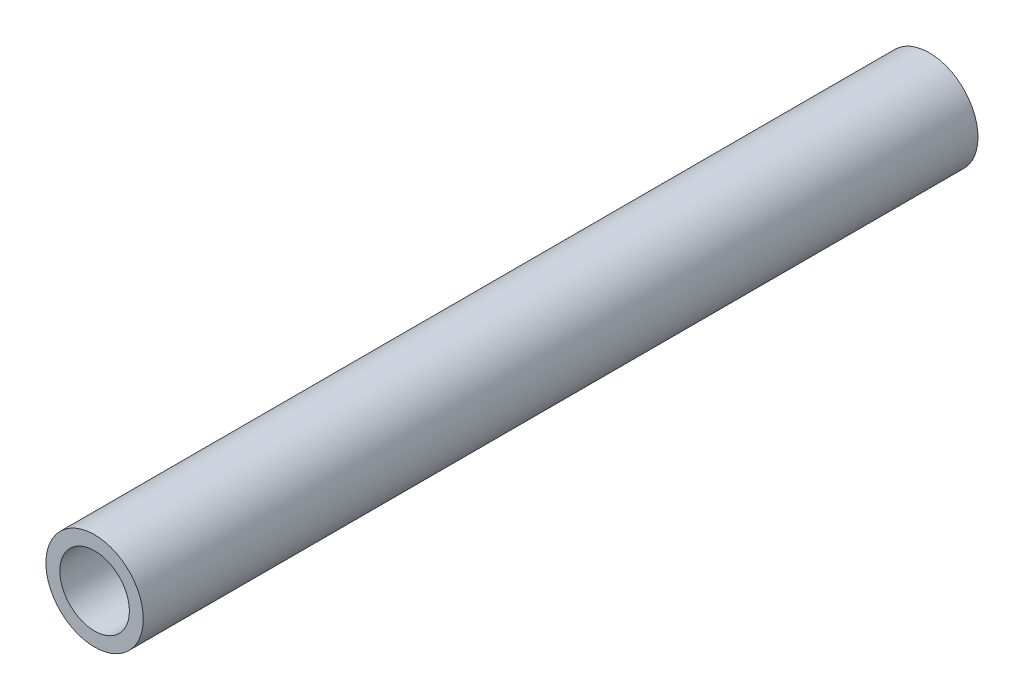
ISO-10303-21;
HEADER;
FILE_DESCRIPTION(('STEP AP214'),'2;1');
FILE_NAME('part.step','',(''),(''),'','','');
FILE_SCHEMA(('AUTOMOTIVE_DESIGN { 1 0 10303 214 1 1 1 1 }'));
ENDSEC;
DATA;
#1=APPLICATION_CONTEXT('core data for automotive mechanical design processes');
#2=APPLICATION_PROTOCOL_DEFINITION('international standard','automotive_design',2000,#1);
#3=PRODUCT_CONTEXT('',#1,'mechanical');
#4=PRODUCT('Part','Part','',(#3));
#5=PRODUCT_RELATED_PRODUCT_CATEGORY('part','',(#4));
#6=PRODUCT_DEFINITION_FORMATION('','',#4);
#7=PRODUCT_DEFINITION_CONTEXT('part definition',#1,'design');
#8=PRODUCT_DEFINITION('design','',#6,#7);
#9=PRODUCT_DEFINITION_SHAPE('','',#8);
#10=(LENGTH_UNIT() NAMED_UNIT(*) SI_UNIT(.MILLI.,.METRE.));
#11=(NAMED_UNIT(*) PLANE_ANGLE_UNIT() SI_UNIT($,.RADIAN.));
#12=(NAMED_UNIT(*) SI_UNIT($,.STERADIAN.) SOLID_ANGLE_UNIT());
#13=UNCERTAINTY_MEASURE_WITH_UNIT(LENGTH_MEASURE(1.E-05),#10,'distance_accuracy_value','');
#14=(GEOMETRIC_REPRESENTATION_CONTEXT(3) GLOBAL_UNCERTAINTY_ASSIGNED_CONTEXT((#13)) GLOBAL_UNIT_ASSIGNED_CONTEXT((#10,
#11,#12)) REPRESENTATION_CONTEXT('',''));
#15=CARTESIAN_POINT('',(0.,0.,0.));
#16=DIRECTION('',(0.,0.,1.));
#17=DIRECTION('',(1.,0.,0.));
#18=AXIS2_PLACEMENT_3D('',#15,#16,#17);
#19=CARTESIAN_POINT('',(0.,0.,228.6));
#20=DIRECTION('',(0.,0.,1.));
#21=DIRECTION('',(1.,0.,0.));
#22=AXIS2_PLACEMENT_3D('',#19,#20,#21);
#23=PLANE('',#22);
#24=CARTESIAN_POINT('',(0.,0.,228.6));
#25=DIRECTION('',(0.,0.,1.));
#26=DIRECTION('',(1.,0.,0.));
#27=AXIS2_PLACEMENT_3D('',#24,#25,#26);
#28=CIRCLE('',#27,13.335);
#29=CARTESIAN_POINT('',(13.335,0.,228.6));
#30=VERTEX_POINT('',#29);
#31=EDGE_CURVE('E10',#30,#30,#28,.T.);
#32=ORIENTED_EDGE('',*,*,#31,.T.);
#33=EDGE_LOOP('',(#32));
#34=FACE_BOUND('',#33,.T.);
#35=CARTESIAN_POINT('',(0.,0.,228.6));
#36=DIRECTION('',(0.,0.,1.));
#37=DIRECTION('',(1.,0.,0.));
#38=AXIS2_PLACEMENT_3D('',#35,#36,#37);
#39=CIRCLE('',#38,9.525);
#40=CARTESIAN_POINT('',(9.525,0.,228.6));
#41=VERTEX_POINT('',#40);
#42=EDGE_CURVE('E50',#41,#41,#39,.T.);
#43=ORIENTED_EDGE('',*,*,#42,.F.);
#44=EDGE_LOOP('',(#43));
#45=FACE_BOUND('',#44,.T.);
#46=ADVANCED_FACE('F37',(#34,#45),#23,.T.);
#47=CARTESIAN_POINT('',(0.,0.,0.));
#48=DIRECTION('',(0.,0.,1.));
#49=DIRECTION('',(1.,0.,0.));
#50=AXIS2_PLACEMENT_3D('',#47,#48,#49);
#51=PLANE('',#50);
#52=CARTESIAN_POINT('',(0.,0.,0.));
#53=DIRECTION('',(0.,0.,1.));
#54=DIRECTION('',(1.,0.,0.));
#55=AXIS2_PLACEMENT_3D('',#52,#53,#54);
#56=CIRCLE('',#55,13.335);
#57=CARTESIAN_POINT('',(13.335,0.,0.));
#58=VERTEX_POINT('',#57);
#59=EDGE_CURVE('E41',#58,#58,#56,.T.);
#60=ORIENTED_EDGE('',*,*,#59,.F.);
#61=EDGE_LOOP('',(#60));
#62=FACE_BOUND('',#61,.T.);
#63=CARTESIAN_POINT('',(0.,0.,0.));
#64=DIRECTION('',(0.,0.,1.));
#65=DIRECTION('',(1.,0.,0.));
#66=AXIS2_PLACEMENT_3D('',#63,#64,#65);
#67=CIRCLE('',#66,9.525);
#68=CARTESIAN_POINT('',(9.525,0.,0.));
#69=VERTEX_POINT('',#68);
#70=EDGE_CURVE('E52',#69,#69,#67,.T.);
#71=ORIENTED_EDGE('',*,*,#70,.T.);
#72=EDGE_LOOP('',(#71));
#73=FACE_BOUND('',#72,.T.);
#74=ADVANCED_FACE('F64',(#62,#73),#51,.F.);
#75=CARTESIAN_POINT('',(0.,0.,228.6));
#76=DIRECTION('',(0.,0.,-1.));
#77=DIRECTION('',(-1.,0.,0.));
#78=AXIS2_PLACEMENT_3D('',#75,#76,#77);
#79=CYLINDRICAL_SURFACE('',#78,13.335);
#80=ORIENTED_EDGE('',*,*,#31,.F.);
#81=EDGE_LOOP('',(#80));
#82=FACE_BOUND('',#81,.T.);
#83=ORIENTED_EDGE('',*,*,#59,.T.);
#84=EDGE_LOOP('',(#83));
#85=FACE_BOUND('',#84,.T.);
#86=ADVANCED_FACE('F39',(#82,#85),#79,.T.);
#87=CARTESIAN_POINT('',(0.,0.,228.6));
#88=DIRECTION('',(0.,0.,-1.));
#89=DIRECTION('',(-1.,0.,0.));
#90=AXIS2_PLACEMENT_3D('',#87,#88,#89);
#91=CYLINDRICAL_SURFACE('',#90,9.525);
#92=ORIENTED_EDGE('',*,*,#42,.T.);
#93=EDGE_LOOP('',(#92));
#94=FACE_BOUND('',#93,.T.);
#95=ORIENTED_EDGE('',*,*,#70,.F.);
#96=EDGE_LOOP('',(#95));
#97=FACE_BOUND('',#96,.T.);
#98=ADVANCED_FACE('F60',(#94,#97),#91,.F.);
#99=CLOSED_SHELL('',(#46,#74,#86,#98));
#100=MANIFOLD_SOLID_BREP('B2',#99);
#101=ADVANCED_BREP_SHAPE_REPRESENTATION('',(#18,#100),#14);
#102=SHAPE_DEFINITION_REPRESENTATION(#9,#101);
ENDSEC;
END-ISO-10303-21;
